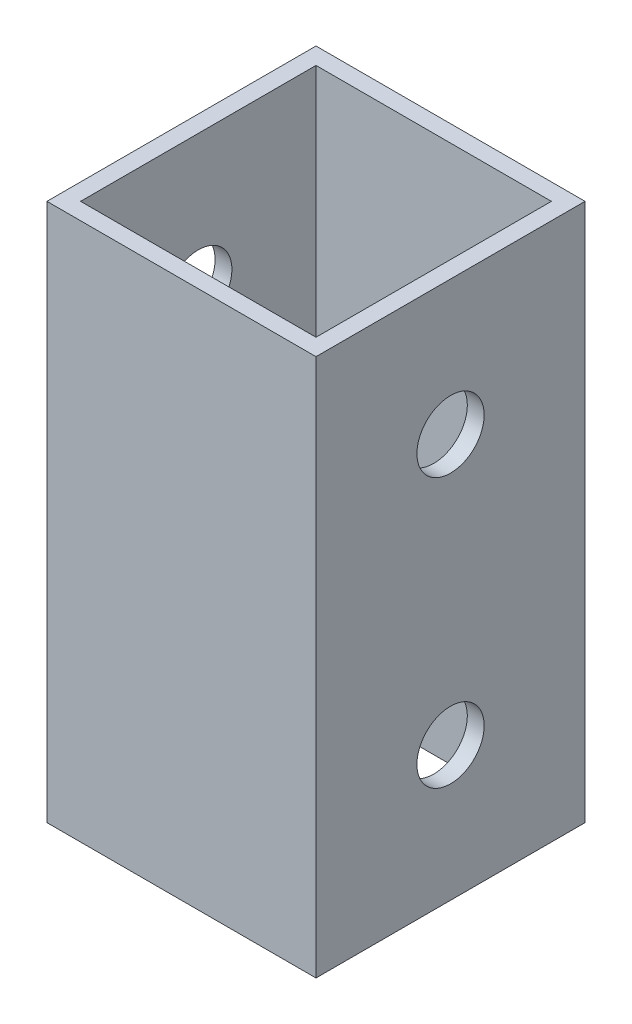
ISO-10303-21;
HEADER;
FILE_DESCRIPTION(('STEP AP214'),'2;1');
FILE_NAME('part.step','',(''),(''),'','','');
FILE_SCHEMA(('AUTOMOTIVE_DESIGN { 1 0 10303 214 1 1 1 1 }'));
ENDSEC;
DATA;
#1=APPLICATION_CONTEXT('core data for automotive mechanical design processes');
#2=APPLICATION_PROTOCOL_DEFINITION('international standard','automotive_design',2000,#1);
#3=PRODUCT_CONTEXT('',#1,'mechanical');
#4=PRODUCT('Part','Part','',(#3));
#5=PRODUCT_RELATED_PRODUCT_CATEGORY('part','',(#4));
#6=PRODUCT_DEFINITION_FORMATION('','',#4);
#7=PRODUCT_DEFINITION_CONTEXT('part definition',#1,'design');
#8=PRODUCT_DEFINITION('design','',#6,#7);
#9=PRODUCT_DEFINITION_SHAPE('','',#8);
#10=(LENGTH_UNIT() NAMED_UNIT(*) SI_UNIT(.MILLI.,.METRE.));
#11=(NAMED_UNIT(*) PLANE_ANGLE_UNIT() SI_UNIT($,.RADIAN.));
#12=(NAMED_UNIT(*) SI_UNIT($,.STERADIAN.) SOLID_ANGLE_UNIT());
#13=UNCERTAINTY_MEASURE_WITH_UNIT(LENGTH_MEASURE(1.E-05),#10,'distance_accuracy_value','');
#14=(GEOMETRIC_REPRESENTATION_CONTEXT(3) GLOBAL_UNCERTAINTY_ASSIGNED_CONTEXT((#13)) GLOBAL_UNIT_ASSIGNED_CONTEXT((#10,
#11,#12)) REPRESENTATION_CONTEXT('',''));
#15=CARTESIAN_POINT('',(0.,0.,0.));
#16=DIRECTION('',(0.,0.,1.));
#17=DIRECTION('',(1.,0.,0.));
#18=AXIS2_PLACEMENT_3D('',#15,#16,#17);
#19=CARTESIAN_POINT('',(0.,50.8,0.));
#20=DIRECTION('',(0.,-1.,0.));
#21=DIRECTION('',(0.,0.,-1.));
#22=AXIS2_PLACEMENT_3D('',#19,#20,#21);
#23=PLANE('',#22);
#24=DIRECTION('',(0.,0.,-1.));
#25=VECTOR('',#24,1.);
#26=CARTESIAN_POINT('',(12.7,50.8,12.7));
#27=LINE('',#26,#25);
#28=CARTESIAN_POINT('',(12.7,50.8,12.7));
#29=VERTEX_POINT('',#28);
#30=CARTESIAN_POINT('',(12.7,50.8,-12.7));
#31=VERTEX_POINT('',#30);
#32=EDGE_CURVE('E138',#29,#31,#27,.T.);
#33=ORIENTED_EDGE('',*,*,#32,.T.);
#34=DIRECTION('',(-1.,0.,0.));
#35=VECTOR('',#34,1.);
#36=CARTESIAN_POINT('',(-12.7,50.8,-12.7));
#37=LINE('',#36,#35);
#38=CARTESIAN_POINT('',(-12.7,50.8,-12.7));
#39=VERTEX_POINT('',#38);
#40=EDGE_CURVE('E141',#31,#39,#37,.T.);
#41=ORIENTED_EDGE('',*,*,#40,.T.);
#42=DIRECTION('',(0.,0.,1.));
#43=VECTOR('',#42,1.);
#44=CARTESIAN_POINT('',(-12.7,50.8,12.7));
#45=LINE('',#44,#43);
#46=CARTESIAN_POINT('',(-12.7,50.8,12.7));
#47=VERTEX_POINT('',#46);
#48=EDGE_CURVE('E144',#39,#47,#45,.T.);
#49=ORIENTED_EDGE('',*,*,#48,.T.);
#50=DIRECTION('',(1.,0.,0.));
#51=VECTOR('',#50,1.);
#52=CARTESIAN_POINT('',(-12.7,50.8,12.7));
#53=LINE('',#52,#51);
#54=EDGE_CURVE('E146',#47,#29,#53,.T.);
#55=ORIENTED_EDGE('',*,*,#54,.T.);
#56=EDGE_LOOP('',(#33,#41,#49,#55));
#57=FACE_BOUND('',#56,.T.);
#58=DIRECTION('',(0.,0.,1.));
#59=VECTOR('',#58,1.);
#60=CARTESIAN_POINT('',(-11.1125,50.8,11.1125));
#61=LINE('',#60,#59);
#62=CARTESIAN_POINT('',(-11.1125,50.8,-11.1125));
#63=VERTEX_POINT('',#62);
#64=CARTESIAN_POINT('',(-11.1125,50.8,11.1125));
#65=VERTEX_POINT('',#64);
#66=EDGE_CURVE('E100',#63,#65,#61,.T.);
#67=ORIENTED_EDGE('',*,*,#66,.F.);
#68=DIRECTION('',(-1.,0.,0.));
#69=VECTOR('',#68,1.);
#70=CARTESIAN_POINT('',(11.1125,50.8,-11.1125));
#71=LINE('',#70,#69);
#72=CARTESIAN_POINT('',(11.1125,50.8,-11.1125));
#73=VERTEX_POINT('',#72);
#74=EDGE_CURVE('E122',#73,#63,#71,.T.);
#75=ORIENTED_EDGE('',*,*,#74,.F.);
#76=DIRECTION('',(0.,0.,-1.));
#77=VECTOR('',#76,1.);
#78=CARTESIAN_POINT('',(11.1125,50.8,11.1125));
#79=LINE('',#78,#77);
#80=CARTESIAN_POINT('',(11.1125,50.8,11.1125));
#81=VERTEX_POINT('',#80);
#82=EDGE_CURVE('E120',#81,#73,#79,.T.);
#83=ORIENTED_EDGE('',*,*,#82,.F.);
#84=DIRECTION('',(1.,0.,0.));
#85=VECTOR('',#84,1.);
#86=CARTESIAN_POINT('',(11.1125,50.8,11.1125));
#87=LINE('',#86,#85);
#88=EDGE_CURVE('E108',#65,#81,#87,.T.);
#89=ORIENTED_EDGE('',*,*,#88,.F.);
#90=EDGE_LOOP('',(#67,#75,#83,#89));
#91=FACE_BOUND('',#90,.T.);
#92=ADVANCED_FACE('F33',(#57,#91),#23,.F.);
#93=CARTESIAN_POINT('',(0.,0.,0.));
#94=DIRECTION('',(0.,-1.,0.));
#95=DIRECTION('',(0.,0.,-1.));
#96=AXIS2_PLACEMENT_3D('',#93,#94,#95);
#97=PLANE('',#96);
#98=DIRECTION('',(0.,0.,-1.));
#99=VECTOR('',#98,1.);
#100=CARTESIAN_POINT('',(12.7,0.,12.7));
#101=LINE('',#100,#99);
#102=CARTESIAN_POINT('',(12.7,0.,12.7));
#103=VERTEX_POINT('',#102);
#104=CARTESIAN_POINT('',(12.7,0.,-12.7));
#105=VERTEX_POINT('',#104);
#106=EDGE_CURVE('E116',#103,#105,#101,.T.);
#107=ORIENTED_EDGE('',*,*,#106,.F.);
#108=DIRECTION('',(1.,0.,0.));
#109=VECTOR('',#108,1.);
#110=CARTESIAN_POINT('',(-12.7,0.,12.7));
#111=LINE('',#110,#109);
#112=CARTESIAN_POINT('',(-12.7,0.,12.7));
#113=VERTEX_POINT('',#112);
#114=EDGE_CURVE('E142',#113,#103,#111,.T.);
#115=ORIENTED_EDGE('',*,*,#114,.F.);
#116=DIRECTION('',(0.,0.,1.));
#117=VECTOR('',#116,1.);
#118=CARTESIAN_POINT('',(-12.7,0.,12.7));
#119=LINE('',#118,#117);
#120=CARTESIAN_POINT('',(-12.7,0.,-12.7));
#121=VERTEX_POINT('',#120);
#122=EDGE_CURVE('E153',#121,#113,#119,.T.);
#123=ORIENTED_EDGE('',*,*,#122,.F.);
#124=DIRECTION('',(-1.,0.,0.));
#125=VECTOR('',#124,1.);
#126=CARTESIAN_POINT('',(-12.7,0.,-12.7));
#127=LINE('',#126,#125);
#128=EDGE_CURVE('E151',#105,#121,#127,.T.);
#129=ORIENTED_EDGE('',*,*,#128,.F.);
#130=EDGE_LOOP('',(#107,#115,#123,#129));
#131=FACE_BOUND('',#130,.T.);
#132=DIRECTION('',(-1.,0.,0.));
#133=VECTOR('',#132,1.);
#134=CARTESIAN_POINT('',(11.1125,0.,-11.1125));
#135=LINE('',#134,#133);
#136=CARTESIAN_POINT('',(11.1125,0.,-11.1125));
#137=VERTEX_POINT('',#136);
#138=CARTESIAN_POINT('',(-11.1125,0.,-11.1125));
#139=VERTEX_POINT('',#138);
#140=EDGE_CURVE('E109',#137,#139,#135,.T.);
#141=ORIENTED_EDGE('',*,*,#140,.T.);
#142=DIRECTION('',(0.,0.,1.));
#143=VECTOR('',#142,1.);
#144=CARTESIAN_POINT('',(-11.1125,0.,11.1125));
#145=LINE('',#144,#143);
#146=CARTESIAN_POINT('',(-11.1125,0.,11.1125));
#147=VERTEX_POINT('',#146);
#148=EDGE_CURVE('E58',#139,#147,#145,.T.);
#149=ORIENTED_EDGE('',*,*,#148,.T.);
#150=DIRECTION('',(1.,0.,0.));
#151=VECTOR('',#150,1.);
#152=CARTESIAN_POINT('',(11.1125,0.,11.1125));
#153=LINE('',#152,#151);
#154=CARTESIAN_POINT('',(11.1125,0.,11.1125));
#155=VERTEX_POINT('',#154);
#156=EDGE_CURVE('E115',#147,#155,#153,.T.);
#157=ORIENTED_EDGE('',*,*,#156,.T.);
#158=DIRECTION('',(0.,0.,-1.));
#159=VECTOR('',#158,1.);
#160=CARTESIAN_POINT('',(11.1125,0.,11.1125));
#161=LINE('',#160,#159);
#162=EDGE_CURVE('E130',#155,#137,#161,.T.);
#163=ORIENTED_EDGE('',*,*,#162,.T.);
#164=EDGE_LOOP('',(#141,#149,#157,#163));
#165=FACE_BOUND('',#164,.T.);
#166=ADVANCED_FACE('F200',(#131,#165),#97,.T.);
#167=CARTESIAN_POINT('',(12.7,50.8,12.7));
#168=DIRECTION('',(-1.,0.,0.));
#169=DIRECTION('',(0.,0.,1.));
#170=AXIS2_PLACEMENT_3D('',#167,#168,#169);
#171=PLANE('',#170);
#172=CARTESIAN_POINT('',(12.7,38.1,0.));
#173=DIRECTION('',(1.,0.,0.));
#174=DIRECTION('',(0.,0.,-1.));
#175=AXIS2_PLACEMENT_3D('',#172,#173,#174);
#176=CIRCLE('',#175,3.175);
#177=CARTESIAN_POINT('',(12.7,38.1,-3.175));
#178=VERTEX_POINT('',#177);
#179=EDGE_CURVE('E171',#178,#178,#176,.T.);
#180=ORIENTED_EDGE('',*,*,#179,.F.);
#181=EDGE_LOOP('',(#180));
#182=FACE_BOUND('',#181,.T.);
#183=CARTESIAN_POINT('',(12.7,12.7,0.));
#184=DIRECTION('',(1.,0.,0.));
#185=DIRECTION('',(0.,0.,-1.));
#186=AXIS2_PLACEMENT_3D('',#183,#184,#185);
#187=CIRCLE('',#186,3.175);
#188=CARTESIAN_POINT('',(12.7,12.7,-3.175));
#189=VERTEX_POINT('',#188);
#190=EDGE_CURVE('E181',#189,#189,#187,.T.);
#191=ORIENTED_EDGE('',*,*,#190,.F.);
#192=EDGE_LOOP('',(#191));
#193=FACE_BOUND('',#192,.T.);
#194=ORIENTED_EDGE('',*,*,#106,.T.);
#195=DIRECTION('',(0.,-1.,0.));
#196=VECTOR('',#195,1.);
#197=CARTESIAN_POINT('',(12.7,50.8,-12.7));
#198=LINE('',#197,#196);
#199=EDGE_CURVE('E11',#31,#105,#198,.T.);
#200=ORIENTED_EDGE('',*,*,#199,.F.);
#201=ORIENTED_EDGE('',*,*,#32,.F.);
#202=DIRECTION('',(0.,-1.,0.));
#203=VECTOR('',#202,1.);
#204=CARTESIAN_POINT('',(12.7,50.8,12.7));
#205=LINE('',#204,#203);
#206=EDGE_CURVE('E148',#29,#103,#205,.T.);
#207=ORIENTED_EDGE('',*,*,#206,.T.);
#208=EDGE_LOOP('',(#194,#200,#201,#207));
#209=FACE_BOUND('',#208,.T.);
#210=ADVANCED_FACE('F35',(#182,#193,#209),#171,.F.);
#211=CARTESIAN_POINT('',(-12.7,50.8,-12.7));
#212=DIRECTION('',(0.,0.,1.));
#213=DIRECTION('',(1.,0.,0.));
#214=AXIS2_PLACEMENT_3D('',#211,#212,#213);
#215=PLANE('',#214);
#216=ORIENTED_EDGE('',*,*,#128,.T.);
#217=DIRECTION('',(0.,-1.,0.));
#218=VECTOR('',#217,1.);
#219=CARTESIAN_POINT('',(-12.7,50.8,-12.7));
#220=LINE('',#219,#218);
#221=EDGE_CURVE('E42',#39,#121,#220,.T.);
#222=ORIENTED_EDGE('',*,*,#221,.F.);
#223=ORIENTED_EDGE('',*,*,#40,.F.);
#224=ORIENTED_EDGE('',*,*,#199,.T.);
#225=EDGE_LOOP('',(#216,#222,#223,#224));
#226=FACE_BOUND('',#225,.T.);
#227=ADVANCED_FACE('F227',(#226),#215,.F.);
#228=CARTESIAN_POINT('',(-12.7,50.8,12.7));
#229=DIRECTION('',(1.,0.,0.));
#230=DIRECTION('',(0.,0.,-1.));
#231=AXIS2_PLACEMENT_3D('',#228,#229,#230);
#232=PLANE('',#231);
#233=CARTESIAN_POINT('',(-12.7,38.1,0.));
#234=DIRECTION('',(1.,0.,0.));
#235=DIRECTION('',(0.,0.,-1.));
#236=AXIS2_PLACEMENT_3D('',#233,#234,#235);
#237=CIRCLE('',#236,3.175);
#238=CARTESIAN_POINT('',(-12.7,38.1,-3.175));
#239=VERTEX_POINT('',#238);
#240=EDGE_CURVE('E165',#239,#239,#237,.T.);
#241=ORIENTED_EDGE('',*,*,#240,.T.);
#242=EDGE_LOOP('',(#241));
#243=FACE_BOUND('',#242,.T.);
#244=CARTESIAN_POINT('',(-12.7,12.7,0.));
#245=DIRECTION('',(1.,0.,0.));
#246=DIRECTION('',(0.,0.,-1.));
#247=AXIS2_PLACEMENT_3D('',#244,#245,#246);
#248=CIRCLE('',#247,3.175);
#249=CARTESIAN_POINT('',(-12.7,12.7,-3.175));
#250=VERTEX_POINT('',#249);
#251=EDGE_CURVE('E176',#250,#250,#248,.T.);
#252=ORIENTED_EDGE('',*,*,#251,.T.);
#253=EDGE_LOOP('',(#252));
#254=FACE_BOUND('',#253,.T.);
#255=ORIENTED_EDGE('',*,*,#122,.T.);
#256=DIRECTION('',(0.,-1.,0.));
#257=VECTOR('',#256,1.);
#258=CARTESIAN_POINT('',(-12.7,50.8,12.7));
#259=LINE('',#258,#257);
#260=EDGE_CURVE('E158',#47,#113,#259,.T.);
#261=ORIENTED_EDGE('',*,*,#260,.F.);
#262=ORIENTED_EDGE('',*,*,#48,.F.);
#263=ORIENTED_EDGE('',*,*,#221,.T.);
#264=EDGE_LOOP('',(#255,#261,#262,#263));
#265=FACE_BOUND('',#264,.T.);
#266=ADVANCED_FACE('F224',(#243,#254,#265),#232,.F.);
#267=CARTESIAN_POINT('',(-12.7,50.8,12.7));
#268=DIRECTION('',(0.,0.,-1.));
#269=DIRECTION('',(-1.,0.,0.));
#270=AXIS2_PLACEMENT_3D('',#267,#268,#269);
#271=PLANE('',#270);
#272=ORIENTED_EDGE('',*,*,#114,.T.);
#273=ORIENTED_EDGE('',*,*,#206,.F.);
#274=ORIENTED_EDGE('',*,*,#54,.F.);
#275=ORIENTED_EDGE('',*,*,#260,.T.);
#276=EDGE_LOOP('',(#272,#273,#274,#275));
#277=FACE_BOUND('',#276,.T.);
#278=ADVANCED_FACE('F221',(#277),#271,.F.);
#279=CARTESIAN_POINT('',(-11.1125,50.8,11.1125));
#280=DIRECTION('',(1.,0.,0.));
#281=DIRECTION('',(0.,0.,-1.));
#282=AXIS2_PLACEMENT_3D('',#279,#280,#281);
#283=PLANE('',#282);
#284=CARTESIAN_POINT('',(-11.1125,38.1,0.));
#285=DIRECTION('',(1.,0.,0.));
#286=DIRECTION('',(0.,0.,-1.));
#287=AXIS2_PLACEMENT_3D('',#284,#285,#286);
#288=CIRCLE('',#287,3.175);
#289=CARTESIAN_POINT('',(-11.1125,38.1,-3.175));
#290=VERTEX_POINT('',#289);
#291=EDGE_CURVE('E128',#290,#290,#288,.T.);
#292=ORIENTED_EDGE('',*,*,#291,.F.);
#293=EDGE_LOOP('',(#292));
#294=FACE_BOUND('',#293,.T.);
#295=CARTESIAN_POINT('',(-11.1125,12.7,0.));
#296=DIRECTION('',(1.,0.,0.));
#297=DIRECTION('',(0.,0.,-1.));
#298=AXIS2_PLACEMENT_3D('',#295,#296,#297);
#299=CIRCLE('',#298,3.175);
#300=CARTESIAN_POINT('',(-11.1125,12.7,-3.175));
#301=VERTEX_POINT('',#300);
#302=EDGE_CURVE('E164',#301,#301,#299,.T.);
#303=ORIENTED_EDGE('',*,*,#302,.F.);
#304=EDGE_LOOP('',(#303));
#305=FACE_BOUND('',#304,.T.);
#306=ORIENTED_EDGE('',*,*,#148,.F.);
#307=DIRECTION('',(0.,-1.,0.));
#308=VECTOR('',#307,1.);
#309=CARTESIAN_POINT('',(-11.1125,50.8,-11.1125));
#310=LINE('',#309,#308);
#311=EDGE_CURVE('E104',#63,#139,#310,.T.);
#312=ORIENTED_EDGE('',*,*,#311,.F.);
#313=ORIENTED_EDGE('',*,*,#66,.T.);
#314=DIRECTION('',(0.,-1.,0.));
#315=VECTOR('',#314,1.);
#316=CARTESIAN_POINT('',(-11.1125,50.8,11.1125));
#317=LINE('',#316,#315);
#318=EDGE_CURVE('E103',#65,#147,#317,.T.);
#319=ORIENTED_EDGE('',*,*,#318,.T.);
#320=EDGE_LOOP('',(#306,#312,#313,#319));
#321=FACE_BOUND('',#320,.T.);
#322=ADVANCED_FACE('F102',(#294,#305,#321),#283,.T.);
#323=CARTESIAN_POINT('',(11.1125,50.8,11.1125));
#324=DIRECTION('',(0.,0.,-1.));
#325=DIRECTION('',(-1.,0.,0.));
#326=AXIS2_PLACEMENT_3D('',#323,#324,#325);
#327=PLANE('',#326);
#328=ORIENTED_EDGE('',*,*,#156,.F.);
#329=ORIENTED_EDGE('',*,*,#318,.F.);
#330=ORIENTED_EDGE('',*,*,#88,.T.);
#331=DIRECTION('',(0.,-1.,0.));
#332=VECTOR('',#331,1.);
#333=CARTESIAN_POINT('',(11.1125,50.8,11.1125));
#334=LINE('',#333,#332);
#335=EDGE_CURVE('E117',#81,#155,#334,.T.);
#336=ORIENTED_EDGE('',*,*,#335,.T.);
#337=EDGE_LOOP('',(#328,#329,#330,#336));
#338=FACE_BOUND('',#337,.T.);
#339=ADVANCED_FACE('F112',(#338),#327,.T.);
#340=CARTESIAN_POINT('',(11.1125,50.8,11.1125));
#341=DIRECTION('',(-1.,0.,0.));
#342=DIRECTION('',(0.,0.,1.));
#343=AXIS2_PLACEMENT_3D('',#340,#341,#342);
#344=PLANE('',#343);
#345=CARTESIAN_POINT('',(11.1125,38.1,0.));
#346=DIRECTION('',(-1.,0.,0.));
#347=DIRECTION('',(0.,0.,1.));
#348=AXIS2_PLACEMENT_3D('',#345,#346,#347);
#349=CIRCLE('',#348,3.175);
#350=CARTESIAN_POINT('',(11.1125,38.1,3.175));
#351=VERTEX_POINT('',#350);
#352=EDGE_CURVE('E37',#351,#351,#349,.T.);
#353=ORIENTED_EDGE('',*,*,#352,.F.);
#354=EDGE_LOOP('',(#353));
#355=FACE_BOUND('',#354,.T.);
#356=CARTESIAN_POINT('',(11.1125,12.7,0.));
#357=DIRECTION('',(-1.,0.,0.));
#358=DIRECTION('',(0.,0.,1.));
#359=AXIS2_PLACEMENT_3D('',#356,#357,#358);
#360=CIRCLE('',#359,3.175);
#361=CARTESIAN_POINT('',(11.1125,12.7,3.175));
#362=VERTEX_POINT('',#361);
#363=EDGE_CURVE('E162',#362,#362,#360,.T.);
#364=ORIENTED_EDGE('',*,*,#363,.F.);
#365=EDGE_LOOP('',(#364));
#366=FACE_BOUND('',#365,.T.);
#367=ORIENTED_EDGE('',*,*,#162,.F.);
#368=ORIENTED_EDGE('',*,*,#335,.F.);
#369=ORIENTED_EDGE('',*,*,#82,.T.);
#370=DIRECTION('',(0.,-1.,0.));
#371=VECTOR('',#370,1.);
#372=CARTESIAN_POINT('',(11.1125,50.8,-11.1125));
#373=LINE('',#372,#371);
#374=EDGE_CURVE('E50',#73,#137,#373,.T.);
#375=ORIENTED_EDGE('',*,*,#374,.T.);
#376=EDGE_LOOP('',(#367,#368,#369,#375));
#377=FACE_BOUND('',#376,.T.);
#378=ADVANCED_FACE('F192',(#355,#366,#377),#344,.T.);
#379=CARTESIAN_POINT('',(11.1125,50.8,-11.1125));
#380=DIRECTION('',(0.,0.,1.));
#381=DIRECTION('',(1.,0.,0.));
#382=AXIS2_PLACEMENT_3D('',#379,#380,#381);
#383=PLANE('',#382);
#384=ORIENTED_EDGE('',*,*,#140,.F.);
#385=ORIENTED_EDGE('',*,*,#374,.F.);
#386=ORIENTED_EDGE('',*,*,#74,.T.);
#387=ORIENTED_EDGE('',*,*,#311,.T.);
#388=EDGE_LOOP('',(#384,#385,#386,#387));
#389=FACE_BOUND('',#388,.T.);
#390=ADVANCED_FACE('F195',(#389),#383,.T.);
#391=CARTESIAN_POINT('',(-12.7,12.7,0.));
#392=DIRECTION('',(1.,0.,0.));
#393=DIRECTION('',(0.,0.,-1.));
#394=AXIS2_PLACEMENT_3D('',#391,#392,#393);
#395=CYLINDRICAL_SURFACE('',#394,3.175);
#396=ORIENTED_EDGE('',*,*,#363,.T.);
#397=EDGE_LOOP('',(#396));
#398=FACE_BOUND('',#397,.T.);
#399=ORIENTED_EDGE('',*,*,#190,.T.);
#400=EDGE_LOOP('',(#399));
#401=FACE_BOUND('',#400,.T.);
#402=ADVANCED_FACE('F202',(#398,#401),#395,.F.);
#403=CARTESIAN_POINT('',(-12.7,38.1,0.));
#404=DIRECTION('',(1.,0.,0.));
#405=DIRECTION('',(0.,0.,-1.));
#406=AXIS2_PLACEMENT_3D('',#403,#404,#405);
#407=CYLINDRICAL_SURFACE('',#406,3.175);
#408=ORIENTED_EDGE('',*,*,#352,.T.);
#409=EDGE_LOOP('',(#408));
#410=FACE_BOUND('',#409,.T.);
#411=ORIENTED_EDGE('',*,*,#179,.T.);
#412=EDGE_LOOP('',(#411));
#413=FACE_BOUND('',#412,.T.);
#414=ADVANCED_FACE('F189',(#410,#413),#407,.F.);
#415=ORIENTED_EDGE('',*,*,#302,.T.);
#416=EDGE_LOOP('',(#415));
#417=FACE_BOUND('',#416,.T.);
#418=ORIENTED_EDGE('',*,*,#251,.F.);
#419=EDGE_LOOP('',(#418));
#420=FACE_BOUND('',#419,.T.);
#421=ADVANCED_FACE('F209',(#417,#420),#395,.F.);
#422=ORIENTED_EDGE('',*,*,#291,.T.);
#423=EDGE_LOOP('',(#422));
#424=FACE_BOUND('',#423,.T.);
#425=ORIENTED_EDGE('',*,*,#240,.F.);
#426=EDGE_LOOP('',(#425));
#427=FACE_BOUND('',#426,.T.);
#428=ADVANCED_FACE('F255',(#424,#427),#407,.F.);
#429=CLOSED_SHELL('',(#92,#166,#210,#227,#266,#278,#322,#339,#378,#390,#402,#414,#421,#428));
#430=MANIFOLD_SOLID_BREP('B2',#429);
#431=ADVANCED_BREP_SHAPE_REPRESENTATION('',(#18,#430),#14);
#432=SHAPE_DEFINITION_REPRESENTATION(#9,#431);
ENDSEC;
END-ISO-10303-21;
